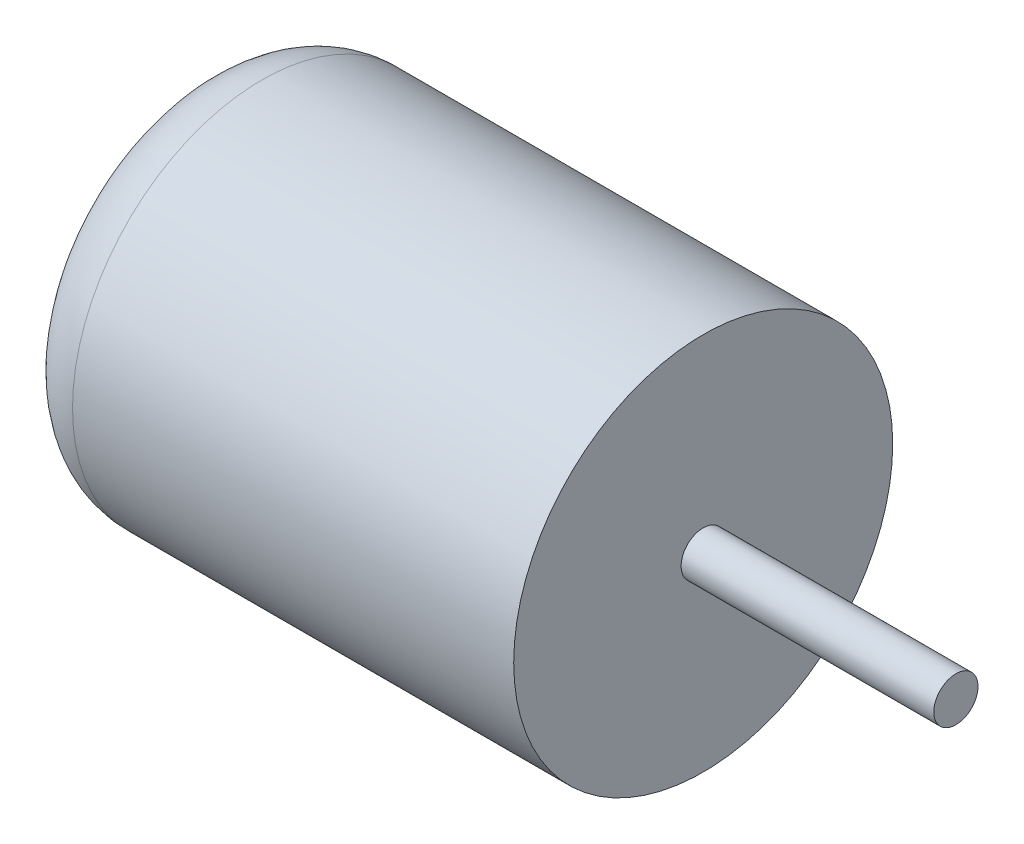
ISO-10303-21;
HEADER;
FILE_DESCRIPTION(('STEP AP214'),'2;1');
FILE_NAME('part.step','',(''),(''),'','','');
FILE_SCHEMA(('AUTOMOTIVE_DESIGN { 1 0 10303 214 1 1 1 1 }'));
ENDSEC;
DATA;
#1=APPLICATION_CONTEXT('core data for automotive mechanical design processes');
#2=APPLICATION_PROTOCOL_DEFINITION('international standard','automotive_design',2000,#1);
#3=PRODUCT_CONTEXT('',#1,'mechanical');
#4=PRODUCT('Part','Part','',(#3));
#5=PRODUCT_RELATED_PRODUCT_CATEGORY('part','',(#4));
#6=PRODUCT_DEFINITION_FORMATION('','',#4);
#7=PRODUCT_DEFINITION_CONTEXT('part definition',#1,'design');
#8=PRODUCT_DEFINITION('design','',#6,#7);
#9=PRODUCT_DEFINITION_SHAPE('','',#8);
#10=(LENGTH_UNIT() NAMED_UNIT(*) SI_UNIT(.MILLI.,.METRE.));
#11=(NAMED_UNIT(*) PLANE_ANGLE_UNIT() SI_UNIT($,.RADIAN.));
#12=(NAMED_UNIT(*) SI_UNIT($,.STERADIAN.) SOLID_ANGLE_UNIT());
#13=UNCERTAINTY_MEASURE_WITH_UNIT(LENGTH_MEASURE(1.E-05),#10,'distance_accuracy_value','');
#14=(GEOMETRIC_REPRESENTATION_CONTEXT(3) GLOBAL_UNCERTAINTY_ASSIGNED_CONTEXT((#13)) GLOBAL_UNIT_ASSIGNED_CONTEXT((#10,
#11,#12)) REPRESENTATION_CONTEXT('',''));
#15=CARTESIAN_POINT('',(0.,0.,0.));
#16=DIRECTION('',(0.,0.,1.));
#17=DIRECTION('',(1.,0.,0.));
#18=AXIS2_PLACEMENT_3D('',#15,#16,#17);
#19=CARTESIAN_POINT('',(20.,0.,0.));
#20=DIRECTION('',(1.,0.,0.));
#21=DIRECTION('',(0.,0.,-1.));
#22=AXIS2_PLACEMENT_3D('',#19,#20,#21);
#23=PLANE('',#22);
#24=CARTESIAN_POINT('',(20.,0.,0.));
#25=DIRECTION('',(1.,0.,0.));
#26=DIRECTION('',(0.,0.,-1.));
#27=AXIS2_PLACEMENT_3D('',#24,#25,#26);
#28=CIRCLE('',#27,7.5);
#29=CARTESIAN_POINT('',(20.,0.,-7.5));
#30=VERTEX_POINT('',#29);
#31=EDGE_CURVE('E41',#30,#30,#28,.T.);
#32=ORIENTED_EDGE('',*,*,#31,.T.);
#33=EDGE_LOOP('',(#32));
#34=FACE_BOUND('',#33,.T.);
#35=CARTESIAN_POINT('',(20.,0.,0.));
#36=DIRECTION('',(1.,0.,0.));
#37=DIRECTION('',(0.,0.,-1.));
#38=AXIS2_PLACEMENT_3D('',#35,#36,#37);
#39=CIRCLE('',#38,0.875);
#40=CARTESIAN_POINT('',(20.,0.,-0.875));
#41=VERTEX_POINT('',#40);
#42=EDGE_CURVE('E48',#41,#41,#39,.T.);
#43=ORIENTED_EDGE('',*,*,#42,.F.);
#44=EDGE_LOOP('',(#43));
#45=FACE_BOUND('',#44,.T.);
#46=ADVANCED_FACE('F30',(#34,#45),#23,.T.);
#47=CARTESIAN_POINT('',(20.,0.,0.));
#48=DIRECTION('',(-1.,0.,0.));
#49=DIRECTION('',(0.,0.,1.));
#50=AXIS2_PLACEMENT_3D('',#47,#48,#49);
#51=CYLINDRICAL_SURFACE('',#50,7.5);
#52=CARTESIAN_POINT('',(2.54,0.,0.));
#53=DIRECTION('',(1.,0.,0.));
#54=DIRECTION('',(0.,0.,-1.));
#55=AXIS2_PLACEMENT_3D('',#52,#53,#54);
#56=CIRCLE('',#55,7.5);
#57=CARTESIAN_POINT('',(2.54,0.,-7.5));
#58=VERTEX_POINT('',#57);
#59=EDGE_CURVE('E37',#58,#58,#56,.T.);
#60=ORIENTED_EDGE('',*,*,#59,.T.);
#61=EDGE_LOOP('',(#60));
#62=FACE_BOUND('',#61,.T.);
#63=ORIENTED_EDGE('',*,*,#31,.F.);
#64=EDGE_LOOP('',(#63));
#65=FACE_BOUND('',#64,.T.);
#66=ADVANCED_FACE('F64',(#62,#65),#51,.T.);
#67=CARTESIAN_POINT('',(0.,0.,0.));
#68=DIRECTION('',(1.,0.,0.));
#69=DIRECTION('',(0.,0.,-1.));
#70=AXIS2_PLACEMENT_3D('',#67,#68,#69);
#71=PLANE('',#70);
#72=CARTESIAN_POINT('',(0.,0.,0.));
#73=DIRECTION('',(1.,0.,0.));
#74=DIRECTION('',(0.,0.,-1.));
#75=AXIS2_PLACEMENT_3D('',#72,#73,#74);
#76=CIRCLE('',#75,4.96);
#77=CARTESIAN_POINT('',(0.,0.,-4.96));
#78=VERTEX_POINT('',#77);
#79=EDGE_CURVE('E10',#78,#78,#76,.F.);
#80=ORIENTED_EDGE('',*,*,#79,.T.);
#81=EDGE_LOOP('',(#80));
#82=FACE_BOUND('',#81,.T.);
#83=ADVANCED_FACE('F59',(#82),#71,.F.);
#84=CARTESIAN_POINT('',(30.,0.,0.));
#85=DIRECTION('',(-1.,0.,0.));
#86=DIRECTION('',(0.,0.,1.));
#87=AXIS2_PLACEMENT_3D('',#84,#85,#86);
#88=CYLINDRICAL_SURFACE('',#87,0.875);
#89=CARTESIAN_POINT('',(30.,0.,0.));
#90=DIRECTION('',(1.,0.,0.));
#91=DIRECTION('',(0.,0.,-1.));
#92=AXIS2_PLACEMENT_3D('',#89,#90,#91);
#93=CIRCLE('',#92,0.875);
#94=CARTESIAN_POINT('',(30.,0.,-0.875));
#95=VERTEX_POINT('',#94);
#96=EDGE_CURVE('E45',#95,#95,#93,.T.);
#97=ORIENTED_EDGE('',*,*,#96,.F.);
#98=EDGE_LOOP('',(#97));
#99=FACE_BOUND('',#98,.T.);
#100=ORIENTED_EDGE('',*,*,#42,.T.);
#101=EDGE_LOOP('',(#100));
#102=FACE_BOUND('',#101,.T.);
#103=ADVANCED_FACE('F56',(#99,#102),#88,.T.);
#104=CARTESIAN_POINT('',(30.,0.,0.));
#105=DIRECTION('',(1.,0.,0.));
#106=DIRECTION('',(0.,0.,-1.));
#107=AXIS2_PLACEMENT_3D('',#104,#105,#106);
#108=PLANE('',#107);
#109=ORIENTED_EDGE('',*,*,#96,.T.);
#110=EDGE_LOOP('',(#109));
#111=FACE_BOUND('',#110,.T.);
#112=ADVANCED_FACE('F54',(#111),#108,.T.);
#113=CARTESIAN_POINT('',(2.54,0.,0.));
#114=DIRECTION('',(1.,0.,0.));
#115=DIRECTION('',(0.,0.,-1.));
#116=AXIS2_PLACEMENT_3D('',#113,#114,#115);
#117=TOROIDAL_SURFACE('',#116,4.96,2.54);
#118=ORIENTED_EDGE('',*,*,#79,.F.);
#119=EDGE_LOOP('',(#118));
#120=FACE_BOUND('',#119,.T.);
#121=ORIENTED_EDGE('',*,*,#59,.F.);
#122=EDGE_LOOP('',(#121));
#123=FACE_BOUND('',#122,.T.);
#124=ADVANCED_FACE('F32',(#120,#123),#117,.T.);
#125=CLOSED_SHELL('',(#46,#66,#83,#103,#112,#124));
#126=MANIFOLD_SOLID_BREP('B2',#125);
#127=ADVANCED_BREP_SHAPE_REPRESENTATION('',(#18,#126),#14);
#128=SHAPE_DEFINITION_REPRESENTATION(#9,#127);
ENDSEC;
END-ISO-10303-21;
